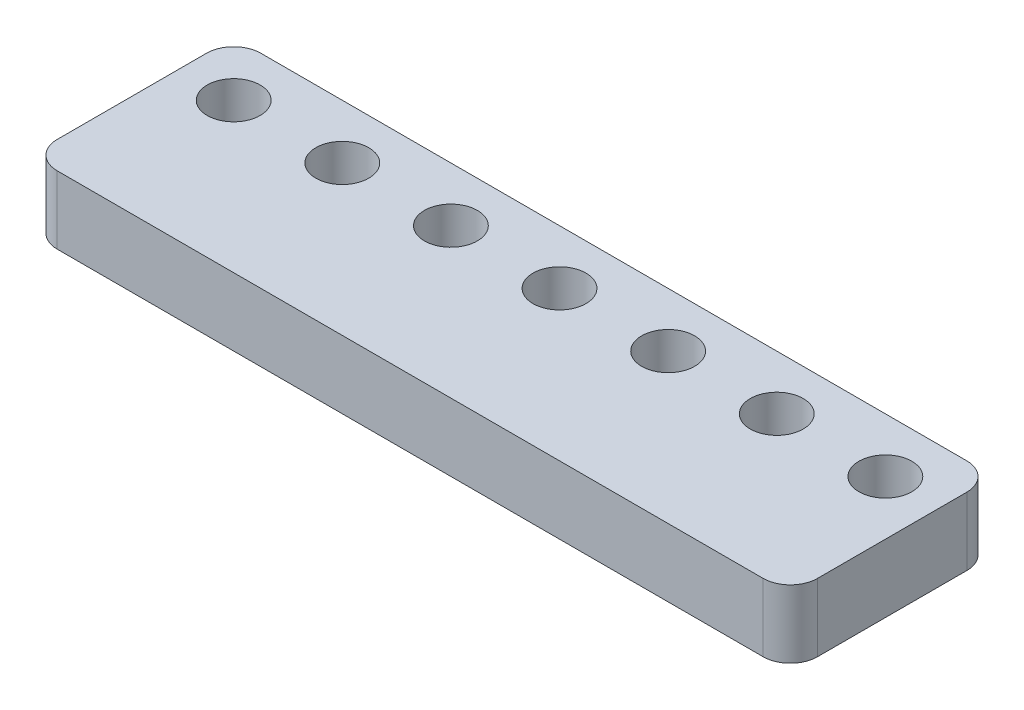
ISO-10303-21;
HEADER;
FILE_DESCRIPTION(('STEP AP214'),'2;1');
FILE_NAME('part.step','',(''),(''),'','','');
FILE_SCHEMA(('AUTOMOTIVE_DESIGN { 1 0 10303 214 1 1 1 1 }'));
ENDSEC;
DATA;
#1=APPLICATION_CONTEXT('core data for automotive mechanical design processes');
#2=APPLICATION_PROTOCOL_DEFINITION('international standard','automotive_design',2000,#1);
#3=PRODUCT_CONTEXT('',#1,'mechanical');
#4=PRODUCT('Part','Part','',(#3));
#5=PRODUCT_RELATED_PRODUCT_CATEGORY('part','',(#4));
#6=PRODUCT_DEFINITION_FORMATION('','',#4);
#7=PRODUCT_DEFINITION_CONTEXT('part definition',#1,'design');
#8=PRODUCT_DEFINITION('design','',#6,#7);
#9=PRODUCT_DEFINITION_SHAPE('','',#8);
#10=(LENGTH_UNIT() NAMED_UNIT(*) SI_UNIT(.MILLI.,.METRE.));
#11=(NAMED_UNIT(*) PLANE_ANGLE_UNIT() SI_UNIT($,.RADIAN.));
#12=(NAMED_UNIT(*) SI_UNIT($,.STERADIAN.) SOLID_ANGLE_UNIT());
#13=UNCERTAINTY_MEASURE_WITH_UNIT(LENGTH_MEASURE(1.E-05),#10,'distance_accuracy_value','');
#14=(GEOMETRIC_REPRESENTATION_CONTEXT(3) GLOBAL_UNCERTAINTY_ASSIGNED_CONTEXT((#13)) GLOBAL_UNIT_ASSIGNED_CONTEXT((#10,
#11,#12)) REPRESENTATION_CONTEXT('',''));
#15=CARTESIAN_POINT('',(0.,0.,0.));
#16=DIRECTION('',(0.,0.,1.));
#17=DIRECTION('',(1.,0.,0.));
#18=AXIS2_PLACEMENT_3D('',#15,#16,#17);
#19=CARTESIAN_POINT('',(-2.,5.,13.));
#20=DIRECTION('',(0.,-1.,0.));
#21=DIRECTION('',(0.,0.,-1.));
#22=AXIS2_PLACEMENT_3D('',#19,#20,#21);
#23=CYLINDRICAL_SURFACE('',#22,2.);
#24=CARTESIAN_POINT('',(-2.,0.,13.));
#25=DIRECTION('',(0.,1.,0.));
#26=DIRECTION('',(0.,0.,1.));
#27=AXIS2_PLACEMENT_3D('',#24,#25,#26);
#28=CIRCLE('',#27,2.);
#29=CARTESIAN_POINT('',(-2.,0.,15.));
#30=VERTEX_POINT('',#29);
#31=CARTESIAN_POINT('',(0.,0.,13.));
#32=VERTEX_POINT('',#31);
#33=EDGE_CURVE('E131',#30,#32,#28,.T.);
#34=ORIENTED_EDGE('',*,*,#33,.T.);
#35=DIRECTION('',(0.,-1.,0.));
#36=VECTOR('',#35,1.);
#37=CARTESIAN_POINT('',(0.,5.,13.));
#38=LINE('',#37,#36);
#39=CARTESIAN_POINT('',(0.,5.,13.));
#40=VERTEX_POINT('',#39);
#41=EDGE_CURVE('E11',#40,#32,#38,.T.);
#42=ORIENTED_EDGE('',*,*,#41,.F.);
#43=CARTESIAN_POINT('',(-2.,5.,13.));
#44=DIRECTION('',(0.,1.,0.));
#45=DIRECTION('',(0.,0.,1.));
#46=AXIS2_PLACEMENT_3D('',#43,#44,#45);
#47=CIRCLE('',#46,2.);
#48=CARTESIAN_POINT('',(-2.,5.,15.));
#49=VERTEX_POINT('',#48);
#50=EDGE_CURVE('E146',#49,#40,#47,.T.);
#51=ORIENTED_EDGE('',*,*,#50,.F.);
#52=DIRECTION('',(0.,-1.,0.));
#53=VECTOR('',#52,1.);
#54=CARTESIAN_POINT('',(-2.,5.,15.));
#55=LINE('',#54,#53);
#56=EDGE_CURVE('E127',#49,#30,#55,.T.);
#57=ORIENTED_EDGE('',*,*,#56,.T.);
#58=EDGE_LOOP('',(#34,#42,#51,#57));
#59=FACE_BOUND('',#58,.T.);
#60=ADVANCED_FACE('F35',(#59),#23,.T.);
#61=CARTESIAN_POINT('',(0.,5.,2.));
#62=DIRECTION('',(-1.,0.,0.));
#63=DIRECTION('',(0.,0.,1.));
#64=AXIS2_PLACEMENT_3D('',#61,#62,#63);
#65=PLANE('',#64);
#66=DIRECTION('',(0.,0.,-1.));
#67=VECTOR('',#66,1.);
#68=CARTESIAN_POINT('',(0.,0.,2.));
#69=LINE('',#68,#67);
#70=CARTESIAN_POINT('',(0.,0.,2.));
#71=VERTEX_POINT('',#70);
#72=EDGE_CURVE('E134',#32,#71,#69,.T.);
#73=ORIENTED_EDGE('',*,*,#72,.T.);
#74=DIRECTION('',(0.,-1.,0.));
#75=VECTOR('',#74,1.);
#76=CARTESIAN_POINT('',(0.,5.,2.));
#77=LINE('',#76,#75);
#78=CARTESIAN_POINT('',(0.,5.,2.));
#79=VERTEX_POINT('',#78);
#80=EDGE_CURVE('E43',#79,#71,#77,.T.);
#81=ORIENTED_EDGE('',*,*,#80,.F.);
#82=DIRECTION('',(0.,0.,-1.));
#83=VECTOR('',#82,1.);
#84=CARTESIAN_POINT('',(0.,5.,2.));
#85=LINE('',#84,#83);
#86=EDGE_CURVE('E94',#40,#79,#85,.T.);
#87=ORIENTED_EDGE('',*,*,#86,.F.);
#88=ORIENTED_EDGE('',*,*,#41,.T.);
#89=EDGE_LOOP('',(#73,#81,#87,#88));
#90=FACE_BOUND('',#89,.T.);
#91=ADVANCED_FACE('F262',(#90),#65,.F.);
#92=CARTESIAN_POINT('',(-2.,5.,2.));
#93=DIRECTION('',(0.,-1.,0.));
#94=DIRECTION('',(0.,0.,-1.));
#95=AXIS2_PLACEMENT_3D('',#92,#93,#94);
#96=CYLINDRICAL_SURFACE('',#95,2.);
#97=CARTESIAN_POINT('',(-2.,0.,2.));
#98=DIRECTION('',(0.,1.,0.));
#99=DIRECTION('',(0.,0.,-1.));
#100=AXIS2_PLACEMENT_3D('',#97,#98,#99);
#101=CIRCLE('',#100,2.);
#102=CARTESIAN_POINT('',(-2.,0.,0.));
#103=VERTEX_POINT('',#102);
#104=EDGE_CURVE('E137',#71,#103,#101,.T.);
#105=ORIENTED_EDGE('',*,*,#104,.T.);
#106=DIRECTION('',(0.,-1.,0.));
#107=VECTOR('',#106,1.);
#108=CARTESIAN_POINT('',(-2.,5.,0.));
#109=LINE('',#108,#107);
#110=CARTESIAN_POINT('',(-2.,5.,0.));
#111=VERTEX_POINT('',#110);
#112=EDGE_CURVE('E153',#111,#103,#109,.T.);
#113=ORIENTED_EDGE('',*,*,#112,.F.);
#114=CARTESIAN_POINT('',(-2.,5.,2.));
#115=DIRECTION('',(0.,1.,0.));
#116=DIRECTION('',(0.,0.,-1.));
#117=AXIS2_PLACEMENT_3D('',#114,#115,#116);
#118=CIRCLE('',#117,2.);
#119=EDGE_CURVE('E161',#79,#111,#118,.T.);
#120=ORIENTED_EDGE('',*,*,#119,.F.);
#121=ORIENTED_EDGE('',*,*,#80,.T.);
#122=EDGE_LOOP('',(#105,#113,#120,#121));
#123=FACE_BOUND('',#122,.T.);
#124=ADVANCED_FACE('F159',(#123),#96,.T.);
#125=CARTESIAN_POINT('',(-54.,5.,0.));
#126=DIRECTION('',(0.,0.,1.));
#127=DIRECTION('',(1.,0.,0.));
#128=AXIS2_PLACEMENT_3D('',#125,#126,#127);
#129=PLANE('',#128);
#130=DIRECTION('',(-1.,0.,0.));
#131=VECTOR('',#130,1.);
#132=CARTESIAN_POINT('',(-54.,0.,0.));
#133=LINE('',#132,#131);
#134=CARTESIAN_POINT('',(-54.,0.,0.));
#135=VERTEX_POINT('',#134);
#136=EDGE_CURVE('E139',#103,#135,#133,.T.);
#137=ORIENTED_EDGE('',*,*,#136,.T.);
#138=DIRECTION('',(0.,-1.,0.));
#139=VECTOR('',#138,1.);
#140=CARTESIAN_POINT('',(-54.,5.,0.));
#141=LINE('',#140,#139);
#142=CARTESIAN_POINT('',(-54.,5.,0.));
#143=VERTEX_POINT('',#142);
#144=EDGE_CURVE('E150',#143,#135,#141,.T.);
#145=ORIENTED_EDGE('',*,*,#144,.F.);
#146=DIRECTION('',(-1.,0.,0.));
#147=VECTOR('',#146,1.);
#148=CARTESIAN_POINT('',(-54.,5.,0.));
#149=LINE('',#148,#147);
#150=EDGE_CURVE('E173',#111,#143,#149,.T.);
#151=ORIENTED_EDGE('',*,*,#150,.F.);
#152=ORIENTED_EDGE('',*,*,#112,.T.);
#153=EDGE_LOOP('',(#137,#145,#151,#152));
#154=FACE_BOUND('',#153,.T.);
#155=ADVANCED_FACE('F169',(#154),#129,.F.);
#156=CARTESIAN_POINT('',(-54.,5.,2.));
#157=DIRECTION('',(0.,-1.,0.));
#158=DIRECTION('',(0.,0.,-1.));
#159=AXIS2_PLACEMENT_3D('',#156,#157,#158);
#160=CYLINDRICAL_SURFACE('',#159,2.);
#161=CARTESIAN_POINT('',(-54.,0.,2.));
#162=DIRECTION('',(0.,1.,0.));
#163=DIRECTION('',(0.,0.,1.));
#164=AXIS2_PLACEMENT_3D('',#161,#162,#163);
#165=CIRCLE('',#164,2.);
#166=CARTESIAN_POINT('',(-56.,0.,2.));
#167=VERTEX_POINT('',#166);
#168=EDGE_CURVE('E141',#135,#167,#165,.T.);
#169=ORIENTED_EDGE('',*,*,#168,.T.);
#170=DIRECTION('',(0.,-1.,0.));
#171=VECTOR('',#170,1.);
#172=CARTESIAN_POINT('',(-56.,5.,2.));
#173=LINE('',#172,#171);
#174=CARTESIAN_POINT('',(-56.,5.,2.));
#175=VERTEX_POINT('',#174);
#176=EDGE_CURVE('E122',#175,#167,#173,.T.);
#177=ORIENTED_EDGE('',*,*,#176,.F.);
#178=CARTESIAN_POINT('',(-54.,5.,2.));
#179=DIRECTION('',(0.,1.,0.));
#180=DIRECTION('',(0.,0.,1.));
#181=AXIS2_PLACEMENT_3D('',#178,#179,#180);
#182=CIRCLE('',#181,2.);
#183=EDGE_CURVE('E113',#143,#175,#182,.T.);
#184=ORIENTED_EDGE('',*,*,#183,.F.);
#185=ORIENTED_EDGE('',*,*,#144,.T.);
#186=EDGE_LOOP('',(#169,#177,#184,#185));
#187=FACE_BOUND('',#186,.T.);
#188=ADVANCED_FACE('F172',(#187),#160,.T.);
#189=CARTESIAN_POINT('',(-56.,5.,2.));
#190=DIRECTION('',(1.,0.,0.));
#191=DIRECTION('',(0.,0.,-1.));
#192=AXIS2_PLACEMENT_3D('',#189,#190,#191);
#193=PLANE('',#192);
#194=DIRECTION('',(0.,0.,1.));
#195=VECTOR('',#194,1.);
#196=CARTESIAN_POINT('',(-56.,0.,2.));
#197=LINE('',#196,#195);
#198=CARTESIAN_POINT('',(-56.,0.,13.));
#199=VERTEX_POINT('',#198);
#200=EDGE_CURVE('E121',#167,#199,#197,.T.);
#201=ORIENTED_EDGE('',*,*,#200,.T.);
#202=DIRECTION('',(0.,-1.,0.));
#203=VECTOR('',#202,1.);
#204=CARTESIAN_POINT('',(-56.,5.,13.));
#205=LINE('',#204,#203);
#206=CARTESIAN_POINT('',(-56.,5.,13.));
#207=VERTEX_POINT('',#206);
#208=EDGE_CURVE('E118',#207,#199,#205,.T.);
#209=ORIENTED_EDGE('',*,*,#208,.F.);
#210=DIRECTION('',(0.,0.,1.));
#211=VECTOR('',#210,1.);
#212=CARTESIAN_POINT('',(-56.,5.,2.));
#213=LINE('',#212,#211);
#214=EDGE_CURVE('E107',#175,#207,#213,.T.);
#215=ORIENTED_EDGE('',*,*,#214,.F.);
#216=ORIENTED_EDGE('',*,*,#176,.T.);
#217=EDGE_LOOP('',(#201,#209,#215,#216));
#218=FACE_BOUND('',#217,.T.);
#219=ADVANCED_FACE('F119',(#218),#193,.F.);
#220=CARTESIAN_POINT('',(-54.,5.,13.));
#221=DIRECTION('',(0.,-1.,0.));
#222=DIRECTION('',(0.,0.,-1.));
#223=AXIS2_PLACEMENT_3D('',#220,#221,#222);
#224=CYLINDRICAL_SURFACE('',#223,2.);
#225=CARTESIAN_POINT('',(-54.,0.,13.));
#226=DIRECTION('',(0.,1.,0.));
#227=DIRECTION('',(0.,0.,1.));
#228=AXIS2_PLACEMENT_3D('',#225,#226,#227);
#229=CIRCLE('',#228,2.);
#230=CARTESIAN_POINT('',(-54.,0.,15.));
#231=VERTEX_POINT('',#230);
#232=EDGE_CURVE('E80',#199,#231,#229,.T.);
#233=ORIENTED_EDGE('',*,*,#232,.T.);
#234=DIRECTION('',(0.,-1.,0.));
#235=VECTOR('',#234,1.);
#236=CARTESIAN_POINT('',(-54.,5.,15.));
#237=LINE('',#236,#235);
#238=CARTESIAN_POINT('',(-54.,5.,15.));
#239=VERTEX_POINT('',#238);
#240=EDGE_CURVE('E123',#239,#231,#237,.T.);
#241=ORIENTED_EDGE('',*,*,#240,.F.);
#242=CARTESIAN_POINT('',(-54.,5.,13.));
#243=DIRECTION('',(0.,1.,0.));
#244=DIRECTION('',(0.,0.,1.));
#245=AXIS2_PLACEMENT_3D('',#242,#243,#244);
#246=CIRCLE('',#245,2.);
#247=EDGE_CURVE('E111',#207,#239,#246,.T.);
#248=ORIENTED_EDGE('',*,*,#247,.F.);
#249=ORIENTED_EDGE('',*,*,#208,.T.);
#250=EDGE_LOOP('',(#233,#241,#248,#249));
#251=FACE_BOUND('',#250,.T.);
#252=ADVANCED_FACE('F125',(#251),#224,.T.);
#253=CARTESIAN_POINT('',(-54.,5.,15.));
#254=DIRECTION('',(0.,0.,-1.));
#255=DIRECTION('',(-1.,0.,0.));
#256=AXIS2_PLACEMENT_3D('',#253,#254,#255);
#257=PLANE('',#256);
#258=DIRECTION('',(1.,0.,0.));
#259=VECTOR('',#258,1.);
#260=CARTESIAN_POINT('',(-54.,0.,15.));
#261=LINE('',#260,#259);
#262=EDGE_CURVE('E86',#231,#30,#261,.T.);
#263=ORIENTED_EDGE('',*,*,#262,.T.);
#264=ORIENTED_EDGE('',*,*,#56,.F.);
#265=DIRECTION('',(1.,0.,0.));
#266=VECTOR('',#265,1.);
#267=CARTESIAN_POINT('',(-54.,5.,15.));
#268=LINE('',#267,#266);
#269=EDGE_CURVE('E51',#239,#49,#268,.T.);
#270=ORIENTED_EDGE('',*,*,#269,.F.);
#271=ORIENTED_EDGE('',*,*,#240,.T.);
#272=EDGE_LOOP('',(#263,#264,#270,#271));
#273=FACE_BOUND('',#272,.T.);
#274=ADVANCED_FACE('F232',(#273),#257,.F.);
#275=CARTESIAN_POINT('',(-2.,5.,13.));
#276=DIRECTION('',(0.,1.,0.));
#277=DIRECTION('',(0.,0.,1.));
#278=AXIS2_PLACEMENT_3D('',#275,#276,#277);
#279=PLANE('',#278);
#280=CARTESIAN_POINT('',(-4.,5.,4.));
#281=DIRECTION('',(0.,1.,0.));
#282=DIRECTION('',(0.,0.,1.));
#283=AXIS2_PLACEMENT_3D('',#280,#281,#282);
#284=CIRCLE('',#283,1.95);
#285=CARTESIAN_POINT('',(-4.,5.,5.95));
#286=VERTEX_POINT('',#285);
#287=EDGE_CURVE('E186',#286,#286,#284,.T.);
#288=ORIENTED_EDGE('',*,*,#287,.F.);
#289=EDGE_LOOP('',(#288));
#290=FACE_BOUND('',#289,.T.);
#291=CARTESIAN_POINT('',(-20.,5.,4.));
#292=DIRECTION('',(0.,1.,0.));
#293=DIRECTION('',(0.,0.,1.));
#294=AXIS2_PLACEMENT_3D('',#291,#292,#293);
#295=CIRCLE('',#294,1.95);
#296=CARTESIAN_POINT('',(-20.,5.,5.95));
#297=VERTEX_POINT('',#296);
#298=EDGE_CURVE('E211',#297,#297,#295,.T.);
#299=ORIENTED_EDGE('',*,*,#298,.F.);
#300=EDGE_LOOP('',(#299));
#301=FACE_BOUND('',#300,.T.);
#302=CARTESIAN_POINT('',(-12.,5.,4.));
#303=DIRECTION('',(0.,1.,0.));
#304=DIRECTION('',(0.,0.,1.));
#305=AXIS2_PLACEMENT_3D('',#302,#303,#304);
#306=CIRCLE('',#305,1.95);
#307=CARTESIAN_POINT('',(-12.,5.,5.95));
#308=VERTEX_POINT('',#307);
#309=EDGE_CURVE('E179',#308,#308,#306,.T.);
#310=ORIENTED_EDGE('',*,*,#309,.F.);
#311=EDGE_LOOP('',(#310));
#312=FACE_BOUND('',#311,.T.);
#313=CARTESIAN_POINT('',(-52.,5.,4.00000000000001));
#314=DIRECTION('',(0.,1.,0.));
#315=DIRECTION('',(0.,0.,1.));
#316=AXIS2_PLACEMENT_3D('',#313,#314,#315);
#317=CIRCLE('',#316,1.95);
#318=CARTESIAN_POINT('',(-52.,5.,5.95000000000001));
#319=VERTEX_POINT('',#318);
#320=EDGE_CURVE('E206',#319,#319,#317,.T.);
#321=ORIENTED_EDGE('',*,*,#320,.F.);
#322=EDGE_LOOP('',(#321));
#323=FACE_BOUND('',#322,.T.);
#324=CARTESIAN_POINT('',(-44.,5.,4.00000000000001));
#325=DIRECTION('',(0.,1.,0.));
#326=DIRECTION('',(0.,0.,1.));
#327=AXIS2_PLACEMENT_3D('',#324,#325,#326);
#328=CIRCLE('',#327,1.95);
#329=CARTESIAN_POINT('',(-44.,5.,5.95));
#330=VERTEX_POINT('',#329);
#331=EDGE_CURVE('E200',#330,#330,#328,.T.);
#332=ORIENTED_EDGE('',*,*,#331,.F.);
#333=EDGE_LOOP('',(#332));
#334=FACE_BOUND('',#333,.T.);
#335=CARTESIAN_POINT('',(-36.,5.,4.));
#336=DIRECTION('',(0.,1.,0.));
#337=DIRECTION('',(0.,0.,1.));
#338=AXIS2_PLACEMENT_3D('',#335,#336,#337);
#339=CIRCLE('',#338,1.95);
#340=CARTESIAN_POINT('',(-36.,5.,5.95));
#341=VERTEX_POINT('',#340);
#342=EDGE_CURVE('E194',#341,#341,#339,.T.);
#343=ORIENTED_EDGE('',*,*,#342,.F.);
#344=EDGE_LOOP('',(#343));
#345=FACE_BOUND('',#344,.T.);
#346=CARTESIAN_POINT('',(-28.,5.,4.));
#347=DIRECTION('',(0.,1.,0.));
#348=DIRECTION('',(0.,0.,1.));
#349=AXIS2_PLACEMENT_3D('',#346,#347,#348);
#350=CIRCLE('',#349,1.95);
#351=CARTESIAN_POINT('',(-28.,5.,5.95));
#352=VERTEX_POINT('',#351);
#353=EDGE_CURVE('E187',#352,#352,#350,.T.);
#354=ORIENTED_EDGE('',*,*,#353,.F.);
#355=EDGE_LOOP('',(#354));
#356=FACE_BOUND('',#355,.T.);
#357=ORIENTED_EDGE('',*,*,#50,.T.);
#358=ORIENTED_EDGE('',*,*,#86,.T.);
#359=ORIENTED_EDGE('',*,*,#119,.T.);
#360=ORIENTED_EDGE('',*,*,#150,.T.);
#361=ORIENTED_EDGE('',*,*,#183,.T.);
#362=ORIENTED_EDGE('',*,*,#214,.T.);
#363=ORIENTED_EDGE('',*,*,#247,.T.);
#364=ORIENTED_EDGE('',*,*,#269,.T.);
#365=EDGE_LOOP('',(#357,#358,#359,#360,#361,#362,#363,#364));
#366=FACE_BOUND('',#365,.T.);
#367=ADVANCED_FACE('F109',(#290,#301,#312,#323,#334,#345,#356,#366),#279,.T.);
#368=CARTESIAN_POINT('',(-2.,0.,13.));
#369=DIRECTION('',(0.,1.,0.));
#370=DIRECTION('',(0.,0.,1.));
#371=AXIS2_PLACEMENT_3D('',#368,#369,#370);
#372=PLANE('',#371);
#373=CARTESIAN_POINT('',(-4.,0.,4.));
#374=DIRECTION('',(0.,1.,0.));
#375=DIRECTION('',(0.,0.,1.));
#376=AXIS2_PLACEMENT_3D('',#373,#374,#375);
#377=CIRCLE('',#376,1.95);
#378=CARTESIAN_POINT('',(-4.,0.,5.95));
#379=VERTEX_POINT('',#378);
#380=EDGE_CURVE('E135',#379,#379,#377,.T.);
#381=ORIENTED_EDGE('',*,*,#380,.T.);
#382=EDGE_LOOP('',(#381));
#383=FACE_BOUND('',#382,.T.);
#384=CARTESIAN_POINT('',(-20.,0.,4.));
#385=DIRECTION('',(0.,1.,0.));
#386=DIRECTION('',(0.,0.,1.));
#387=AXIS2_PLACEMENT_3D('',#384,#385,#386);
#388=CIRCLE('',#387,1.95);
#389=CARTESIAN_POINT('',(-20.,0.,5.95));
#390=VERTEX_POINT('',#389);
#391=EDGE_CURVE('E191',#390,#390,#388,.T.);
#392=ORIENTED_EDGE('',*,*,#391,.T.);
#393=EDGE_LOOP('',(#392));
#394=FACE_BOUND('',#393,.T.);
#395=CARTESIAN_POINT('',(-12.,0.,4.));
#396=DIRECTION('',(0.,1.,0.));
#397=DIRECTION('',(0.,0.,1.));
#398=AXIS2_PLACEMENT_3D('',#395,#396,#397);
#399=CIRCLE('',#398,1.95);
#400=CARTESIAN_POINT('',(-12.,0.,5.95));
#401=VERTEX_POINT('',#400);
#402=EDGE_CURVE('E182',#401,#401,#399,.T.);
#403=ORIENTED_EDGE('',*,*,#402,.T.);
#404=EDGE_LOOP('',(#403));
#405=FACE_BOUND('',#404,.T.);
#406=CARTESIAN_POINT('',(-52.,0.,4.00000000000001));
#407=DIRECTION('',(0.,1.,0.));
#408=DIRECTION('',(0.,0.,1.));
#409=AXIS2_PLACEMENT_3D('',#406,#407,#408);
#410=CIRCLE('',#409,1.95);
#411=CARTESIAN_POINT('',(-52.,0.,5.95000000000001));
#412=VERTEX_POINT('',#411);
#413=EDGE_CURVE('E183',#412,#412,#410,.T.);
#414=ORIENTED_EDGE('',*,*,#413,.T.);
#415=EDGE_LOOP('',(#414));
#416=FACE_BOUND('',#415,.T.);
#417=CARTESIAN_POINT('',(-44.,0.,4.00000000000001));
#418=DIRECTION('',(0.,1.,0.));
#419=DIRECTION('',(0.,0.,1.));
#420=AXIS2_PLACEMENT_3D('',#417,#418,#419);
#421=CIRCLE('',#420,1.95);
#422=CARTESIAN_POINT('',(-44.,0.,5.95));
#423=VERTEX_POINT('',#422);
#424=EDGE_CURVE('E203',#423,#423,#421,.T.);
#425=ORIENTED_EDGE('',*,*,#424,.T.);
#426=EDGE_LOOP('',(#425));
#427=FACE_BOUND('',#426,.T.);
#428=CARTESIAN_POINT('',(-36.,0.,4.));
#429=DIRECTION('',(0.,1.,0.));
#430=DIRECTION('',(0.,0.,1.));
#431=AXIS2_PLACEMENT_3D('',#428,#429,#430);
#432=CIRCLE('',#431,1.95);
#433=CARTESIAN_POINT('',(-36.,0.,5.95));
#434=VERTEX_POINT('',#433);
#435=EDGE_CURVE('E197',#434,#434,#432,.T.);
#436=ORIENTED_EDGE('',*,*,#435,.T.);
#437=EDGE_LOOP('',(#436));
#438=FACE_BOUND('',#437,.T.);
#439=CARTESIAN_POINT('',(-28.,0.,4.));
#440=DIRECTION('',(0.,1.,0.));
#441=DIRECTION('',(0.,0.,1.));
#442=AXIS2_PLACEMENT_3D('',#439,#440,#441);
#443=CIRCLE('',#442,1.95);
#444=CARTESIAN_POINT('',(-28.,0.,5.95));
#445=VERTEX_POINT('',#444);
#446=EDGE_CURVE('E190',#445,#445,#443,.T.);
#447=ORIENTED_EDGE('',*,*,#446,.T.);
#448=EDGE_LOOP('',(#447));
#449=FACE_BOUND('',#448,.T.);
#450=ORIENTED_EDGE('',*,*,#33,.F.);
#451=ORIENTED_EDGE('',*,*,#262,.F.);
#452=ORIENTED_EDGE('',*,*,#232,.F.);
#453=ORIENTED_EDGE('',*,*,#200,.F.);
#454=ORIENTED_EDGE('',*,*,#168,.F.);
#455=ORIENTED_EDGE('',*,*,#136,.F.);
#456=ORIENTED_EDGE('',*,*,#104,.F.);
#457=ORIENTED_EDGE('',*,*,#72,.F.);
#458=EDGE_LOOP('',(#450,#451,#452,#453,#454,#455,#456,#457));
#459=FACE_BOUND('',#458,.T.);
#460=ADVANCED_FACE('F165',(#383,#394,#405,#416,#427,#438,#449,#459),#372,.F.);
#461=CARTESIAN_POINT('',(-28.,0.,4.));
#462=DIRECTION('',(0.,1.,0.));
#463=DIRECTION('',(0.,0.,1.));
#464=AXIS2_PLACEMENT_3D('',#461,#462,#463);
#465=CYLINDRICAL_SURFACE('',#464,1.95);
#466=ORIENTED_EDGE('',*,*,#446,.F.);
#467=EDGE_LOOP('',(#466));
#468=FACE_BOUND('',#467,.T.);
#469=ORIENTED_EDGE('',*,*,#353,.T.);
#470=EDGE_LOOP('',(#469));
#471=FACE_BOUND('',#470,.T.);
#472=ADVANCED_FACE('F246',(#468,#471),#465,.F.);
#473=CARTESIAN_POINT('',(-36.,0.,4.));
#474=DIRECTION('',(0.,1.,0.));
#475=DIRECTION('',(0.,0.,1.));
#476=AXIS2_PLACEMENT_3D('',#473,#474,#475);
#477=CYLINDRICAL_SURFACE('',#476,1.95);
#478=ORIENTED_EDGE('',*,*,#435,.F.);
#479=EDGE_LOOP('',(#478));
#480=FACE_BOUND('',#479,.T.);
#481=ORIENTED_EDGE('',*,*,#342,.T.);
#482=EDGE_LOOP('',(#481));
#483=FACE_BOUND('',#482,.T.);
#484=ADVANCED_FACE('F248',(#480,#483),#477,.F.);
#485=CARTESIAN_POINT('',(-44.,0.,4.00000000000001));
#486=DIRECTION('',(0.,1.,0.));
#487=DIRECTION('',(0.,0.,1.));
#488=AXIS2_PLACEMENT_3D('',#485,#486,#487);
#489=CYLINDRICAL_SURFACE('',#488,1.95);
#490=ORIENTED_EDGE('',*,*,#424,.F.);
#491=EDGE_LOOP('',(#490));
#492=FACE_BOUND('',#491,.T.);
#493=ORIENTED_EDGE('',*,*,#331,.T.);
#494=EDGE_LOOP('',(#493));
#495=FACE_BOUND('',#494,.T.);
#496=ADVANCED_FACE('F255',(#492,#495),#489,.F.);
#497=CARTESIAN_POINT('',(-52.,0.,4.00000000000001));
#498=DIRECTION('',(0.,1.,0.));
#499=DIRECTION('',(0.,0.,1.));
#500=AXIS2_PLACEMENT_3D('',#497,#498,#499);
#501=CYLINDRICAL_SURFACE('',#500,1.95);
#502=ORIENTED_EDGE('',*,*,#413,.F.);
#503=EDGE_LOOP('',(#502));
#504=FACE_BOUND('',#503,.T.);
#505=ORIENTED_EDGE('',*,*,#320,.T.);
#506=EDGE_LOOP('',(#505));
#507=FACE_BOUND('',#506,.T.);
#508=ADVANCED_FACE('F338',(#504,#507),#501,.F.);
#509=CARTESIAN_POINT('',(-12.,0.,4.));
#510=DIRECTION('',(0.,1.,0.));
#511=DIRECTION('',(0.,0.,1.));
#512=AXIS2_PLACEMENT_3D('',#509,#510,#511);
#513=CYLINDRICAL_SURFACE('',#512,1.95);
#514=ORIENTED_EDGE('',*,*,#402,.F.);
#515=EDGE_LOOP('',(#514));
#516=FACE_BOUND('',#515,.T.);
#517=ORIENTED_EDGE('',*,*,#309,.T.);
#518=EDGE_LOOP('',(#517));
#519=FACE_BOUND('',#518,.T.);
#520=ADVANCED_FACE('F348',(#516,#519),#513,.F.);
#521=CARTESIAN_POINT('',(-20.,0.,4.));
#522=DIRECTION('',(0.,1.,0.));
#523=DIRECTION('',(0.,0.,1.));
#524=AXIS2_PLACEMENT_3D('',#521,#522,#523);
#525=CYLINDRICAL_SURFACE('',#524,1.95);
#526=ORIENTED_EDGE('',*,*,#391,.F.);
#527=EDGE_LOOP('',(#526));
#528=FACE_BOUND('',#527,.T.);
#529=ORIENTED_EDGE('',*,*,#298,.T.);
#530=EDGE_LOOP('',(#529));
#531=FACE_BOUND('',#530,.T.);
#532=ADVANCED_FACE('F226',(#528,#531),#525,.F.);
#533=CARTESIAN_POINT('',(-4.,0.,4.));
#534=DIRECTION('',(0.,1.,0.));
#535=DIRECTION('',(0.,0.,1.));
#536=AXIS2_PLACEMENT_3D('',#533,#534,#535);
#537=CYLINDRICAL_SURFACE('',#536,1.95);
#538=ORIENTED_EDGE('',*,*,#380,.F.);
#539=EDGE_LOOP('',(#538));
#540=FACE_BOUND('',#539,.T.);
#541=ORIENTED_EDGE('',*,*,#287,.T.);
#542=EDGE_LOOP('',(#541));
#543=FACE_BOUND('',#542,.T.);
#544=ADVANCED_FACE('F223',(#540,#543),#537,.F.);
#545=CLOSED_SHELL('',(#60,#91,#124,#155,#188,#219,#252,#274,#367,#460,#472,#484,#496,#508,#520,
#532,#544));
#546=MANIFOLD_SOLID_BREP('B2',#545);
#547=ADVANCED_BREP_SHAPE_REPRESENTATION('',(#18,#546),#14);
#548=SHAPE_DEFINITION_REPRESENTATION(#9,#547);
ENDSEC;
END-ISO-10303-21;
